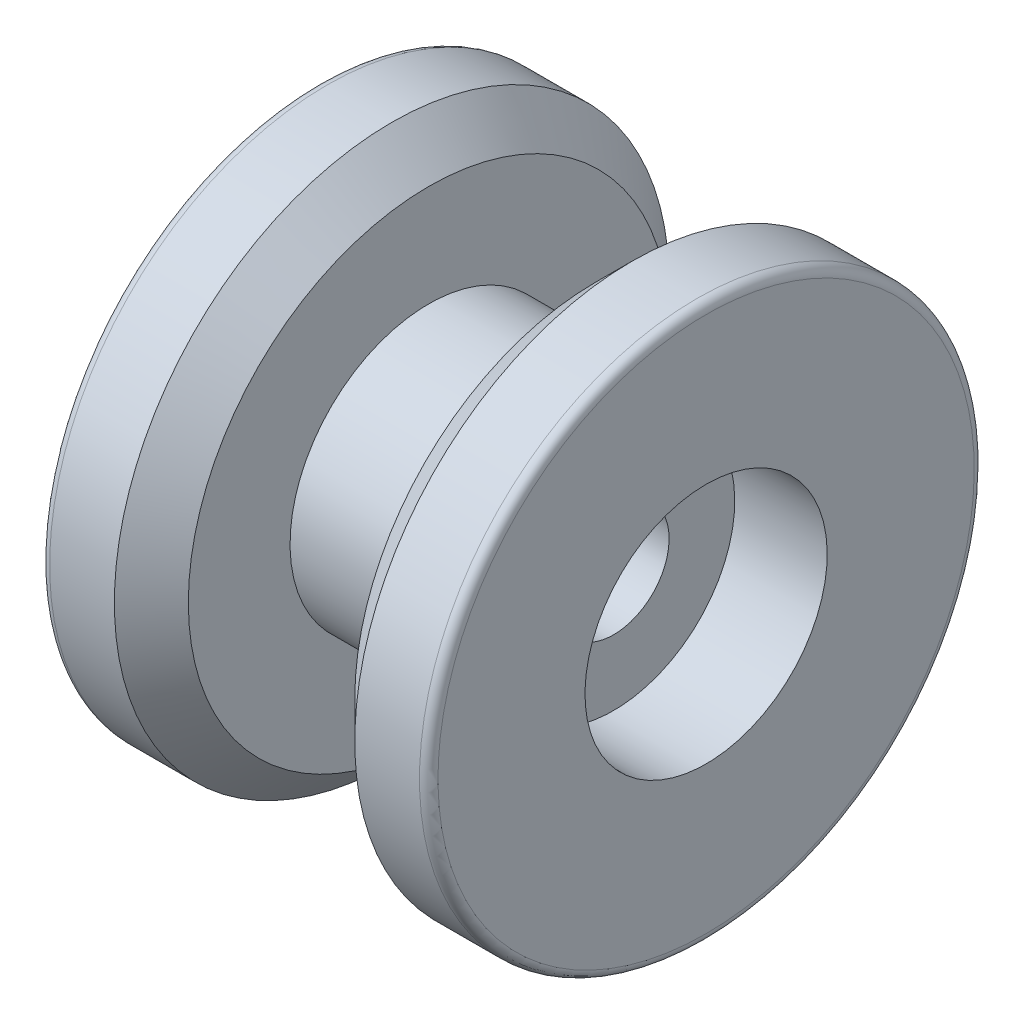
ISO-10303-21;
HEADER;
FILE_DESCRIPTION(('STEP AP214'),'2;1');
FILE_NAME('part.step','',(''),(''),'','','');
FILE_SCHEMA(('AUTOMOTIVE_DESIGN { 1 0 10303 214 1 1 1 1 }'));
ENDSEC;
DATA;
#1=APPLICATION_CONTEXT('core data for automotive mechanical design processes');
#2=APPLICATION_PROTOCOL_DEFINITION('international standard','automotive_design',2000,#1);
#3=PRODUCT_CONTEXT('',#1,'mechanical');
#4=PRODUCT('Part','Part','',(#3));
#5=PRODUCT_RELATED_PRODUCT_CATEGORY('part','',(#4));
#6=PRODUCT_DEFINITION_FORMATION('','',#4);
#7=PRODUCT_DEFINITION_CONTEXT('part definition',#1,'design');
#8=PRODUCT_DEFINITION('design','',#6,#7);
#9=PRODUCT_DEFINITION_SHAPE('','',#8);
#10=(LENGTH_UNIT() NAMED_UNIT(*) SI_UNIT(.MILLI.,.METRE.));
#11=(NAMED_UNIT(*) PLANE_ANGLE_UNIT() SI_UNIT($,.RADIAN.));
#12=(NAMED_UNIT(*) SI_UNIT($,.STERADIAN.) SOLID_ANGLE_UNIT());
#13=UNCERTAINTY_MEASURE_WITH_UNIT(LENGTH_MEASURE(1.E-05),#10,'distance_accuracy_value','');
#14=(GEOMETRIC_REPRESENTATION_CONTEXT(3) GLOBAL_UNCERTAINTY_ASSIGNED_CONTEXT((#13)) GLOBAL_UNIT_ASSIGNED_CONTEXT((#10,
#11,#12)) REPRESENTATION_CONTEXT('',''));
#15=CARTESIAN_POINT('',(0.,0.,0.));
#16=DIRECTION('',(0.,0.,1.));
#17=DIRECTION('',(1.,0.,0.));
#18=AXIS2_PLACEMENT_3D('',#15,#16,#17);
#19=CARTESIAN_POINT('',(-21.,0.,0.));
#20=DIRECTION('',(1.,0.,0.));
#21=DIRECTION('',(0.,1.,0.));
#22=AXIS2_PLACEMENT_3D('',#19,#20,#21);
#23=CYLINDRICAL_SURFACE('',#22,6.);
#24=CARTESIAN_POINT('',(-21.,0.,0.));
#25=DIRECTION('',(1.,0.,0.));
#26=DIRECTION('',(0.,1.,0.));
#27=AXIS2_PLACEMENT_3D('',#24,#25,#26);
#28=CIRCLE('',#27,6.);
#29=CARTESIAN_POINT('',(-21.,6.,0.));
#30=VERTEX_POINT('',#29);
#31=EDGE_CURVE('E89',#30,#30,#28,.T.);
#32=ORIENTED_EDGE('',*,*,#31,.F.);
#33=EDGE_LOOP('',(#32));
#34=FACE_BOUND('',#33,.T.);
#35=CARTESIAN_POINT('',(11.,0.,0.));
#36=DIRECTION('',(1.,0.,0.));
#37=DIRECTION('',(0.,1.,0.));
#38=AXIS2_PLACEMENT_3D('',#35,#36,#37);
#39=CIRCLE('',#38,6.);
#40=CARTESIAN_POINT('',(11.,6.,0.));
#41=VERTEX_POINT('',#40);
#42=EDGE_CURVE('E45',#41,#41,#39,.F.);
#43=ORIENTED_EDGE('',*,*,#42,.F.);
#44=EDGE_LOOP('',(#43));
#45=FACE_BOUND('',#44,.T.);
#46=ADVANCED_FACE('F41',(#34,#45),#23,.F.);
#47=CARTESIAN_POINT('',(-21.,30.,0.));
#48=DIRECTION('',(1.,0.,0.));
#49=DIRECTION('',(0.,1.,0.));
#50=AXIS2_PLACEMENT_3D('',#47,#48,#49);
#51=PLANE('',#50);
#52=CARTESIAN_POINT('',(-21.,0.,0.));
#53=DIRECTION('',(1.,0.,0.));
#54=DIRECTION('',(0.,1.,0.));
#55=AXIS2_PLACEMENT_3D('',#52,#53,#54);
#56=CIRCLE('',#55,29.);
#57=CARTESIAN_POINT('',(-21.,29.,0.));
#58=VERTEX_POINT('',#57);
#59=EDGE_CURVE('E50',#58,#58,#56,.F.);
#60=ORIENTED_EDGE('',*,*,#59,.T.);
#61=EDGE_LOOP('',(#60));
#62=FACE_BOUND('',#61,.T.);
#63=ORIENTED_EDGE('',*,*,#31,.T.);
#64=EDGE_LOOP('',(#63));
#65=FACE_BOUND('',#64,.T.);
#66=ADVANCED_FACE('F109',(#62,#65),#51,.F.);
#67=CARTESIAN_POINT('',(21.,0.,0.));
#68=DIRECTION('',(-1.,0.,0.));
#69=DIRECTION('',(0.,-1.,0.));
#70=AXIS2_PLACEMENT_3D('',#67,#68,#69);
#71=PLANE('',#70);
#72=CARTESIAN_POINT('',(21.,0.,0.));
#73=DIRECTION('',(1.,0.,0.));
#74=DIRECTION('',(0.,1.,0.));
#75=AXIS2_PLACEMENT_3D('',#72,#73,#74);
#76=CIRCLE('',#75,13.1);
#77=CARTESIAN_POINT('',(21.,13.1,0.));
#78=VERTEX_POINT('',#77);
#79=EDGE_CURVE('E93',#78,#78,#76,.T.);
#80=ORIENTED_EDGE('',*,*,#79,.F.);
#81=EDGE_LOOP('',(#80));
#82=FACE_BOUND('',#81,.T.);
#83=CARTESIAN_POINT('',(21.,0.,0.));
#84=DIRECTION('',(-1.,0.,0.));
#85=DIRECTION('',(0.,-1.,0.));
#86=AXIS2_PLACEMENT_3D('',#83,#84,#85);
#87=CIRCLE('',#86,29.);
#88=CARTESIAN_POINT('',(21.,-29.,0.));
#89=VERTEX_POINT('',#88);
#90=EDGE_CURVE('E55',#89,#89,#87,.F.);
#91=ORIENTED_EDGE('',*,*,#90,.T.);
#92=EDGE_LOOP('',(#91));
#93=FACE_BOUND('',#92,.T.);
#94=ADVANCED_FACE('F115',(#82,#93),#71,.F.);
#95=CARTESIAN_POINT('',(-21.,0.,0.));
#96=DIRECTION('',(-1.,0.,0.));
#97=DIRECTION('',(0.,-1.,0.));
#98=AXIS2_PLACEMENT_3D('',#95,#96,#97);
#99=CYLINDRICAL_SURFACE('',#98,30.);
#100=CARTESIAN_POINT('',(20.,0.,0.));
#101=DIRECTION('',(-1.,0.,0.));
#102=DIRECTION('',(0.,-1.,0.));
#103=AXIS2_PLACEMENT_3D('',#100,#101,#102);
#104=CIRCLE('',#103,30.);
#105=CARTESIAN_POINT('',(20.,-30.,0.));
#106=VERTEX_POINT('',#105);
#107=EDGE_CURVE('E61',#106,#106,#104,.T.);
#108=ORIENTED_EDGE('',*,*,#107,.T.);
#109=EDGE_LOOP('',(#108));
#110=FACE_BOUND('',#109,.T.);
#111=CARTESIAN_POINT('',(13.,0.,0.));
#112=DIRECTION('',(1.,0.,0.));
#113=DIRECTION('',(0.,1.,0.));
#114=AXIS2_PLACEMENT_3D('',#111,#112,#113);
#115=CIRCLE('',#114,30.);
#116=CARTESIAN_POINT('',(13.,30.,0.));
#117=VERTEX_POINT('',#116);
#118=EDGE_CURVE('E73',#117,#117,#115,.T.);
#119=ORIENTED_EDGE('',*,*,#118,.T.);
#120=EDGE_LOOP('',(#119));
#121=FACE_BOUND('',#120,.T.);
#122=ADVANCED_FACE('F138',(#110,#121),#99,.T.);
#123=CARTESIAN_POINT('',(9.,30.,0.));
#124=DIRECTION('',(1.,0.,0.));
#125=DIRECTION('',(0.,1.,0.));
#126=AXIS2_PLACEMENT_3D('',#123,#124,#125);
#127=PLANE('',#126);
#128=CARTESIAN_POINT('',(9.,0.,0.));
#129=DIRECTION('',(1.,0.,0.));
#130=DIRECTION('',(0.,1.,0.));
#131=AXIS2_PLACEMENT_3D('',#128,#129,#130);
#132=CIRCLE('',#131,26.);
#133=CARTESIAN_POINT('',(9.,26.,0.));
#134=VERTEX_POINT('',#133);
#135=EDGE_CURVE('E77',#134,#134,#132,.F.);
#136=ORIENTED_EDGE('',*,*,#135,.T.);
#137=EDGE_LOOP('',(#136));
#138=FACE_BOUND('',#137,.T.);
#139=CARTESIAN_POINT('',(9.,0.,0.));
#140=DIRECTION('',(-1.,0.,0.));
#141=DIRECTION('',(0.,-1.,0.));
#142=AXIS2_PLACEMENT_3D('',#139,#140,#141);
#143=CIRCLE('',#142,15.);
#144=CARTESIAN_POINT('',(9.00000000000001,-15.,0.));
#145=VERTEX_POINT('',#144);
#146=EDGE_CURVE('E81',#145,#145,#143,.T.);
#147=ORIENTED_EDGE('',*,*,#146,.F.);
#148=EDGE_LOOP('',(#147));
#149=FACE_BOUND('',#148,.T.);
#150=ADVANCED_FACE('F134',(#138,#149),#127,.F.);
#151=CARTESIAN_POINT('',(-21.,0.,0.));
#152=DIRECTION('',(-1.,0.,0.));
#153=DIRECTION('',(0.,-1.,0.));
#154=AXIS2_PLACEMENT_3D('',#151,#152,#153);
#155=CYLINDRICAL_SURFACE('',#154,15.);
#156=CARTESIAN_POINT('',(-9.,0.,0.));
#157=DIRECTION('',(-1.,0.,0.));
#158=DIRECTION('',(0.,-1.,0.));
#159=AXIS2_PLACEMENT_3D('',#156,#157,#158);
#160=CIRCLE('',#159,15.);
#161=CARTESIAN_POINT('',(-8.99999999999999,-15.,0.));
#162=VERTEX_POINT('',#161);
#163=EDGE_CURVE('E85',#162,#162,#160,.T.);
#164=ORIENTED_EDGE('',*,*,#163,.F.);
#165=EDGE_LOOP('',(#164));
#166=FACE_BOUND('',#165,.T.);
#167=ORIENTED_EDGE('',*,*,#146,.T.);
#168=EDGE_LOOP('',(#167));
#169=FACE_BOUND('',#168,.T.);
#170=ADVANCED_FACE('F130',(#166,#169),#155,.T.);
#171=CARTESIAN_POINT('',(-9.,15.,0.));
#172=DIRECTION('',(-1.,0.,0.));
#173=DIRECTION('',(0.,-1.,0.));
#174=AXIS2_PLACEMENT_3D('',#171,#172,#173);
#175=PLANE('',#174);
#176=CARTESIAN_POINT('',(-8.99999999999999,0.,0.));
#177=DIRECTION('',(-1.,0.,0.));
#178=DIRECTION('',(0.,-1.,0.));
#179=AXIS2_PLACEMENT_3D('',#176,#177,#178);
#180=CIRCLE('',#179,25.9999999999999);
#181=CARTESIAN_POINT('',(-8.99999999999999,-25.9999999999999,0.));
#182=VERTEX_POINT('',#181);
#183=EDGE_CURVE('E65',#182,#182,#180,.F.);
#184=ORIENTED_EDGE('',*,*,#183,.T.);
#185=EDGE_LOOP('',(#184));
#186=FACE_BOUND('',#185,.T.);
#187=ORIENTED_EDGE('',*,*,#163,.T.);
#188=EDGE_LOOP('',(#187));
#189=FACE_BOUND('',#188,.T.);
#190=ADVANCED_FACE('F127',(#186,#189),#175,.F.);
#191=CARTESIAN_POINT('',(-21.,0.,0.));
#192=DIRECTION('',(-1.,0.,0.));
#193=DIRECTION('',(0.,-1.,0.));
#194=AXIS2_PLACEMENT_3D('',#191,#192,#193);
#195=CYLINDRICAL_SURFACE('',#194,30.);
#196=CARTESIAN_POINT('',(-20.,0.,0.));
#197=DIRECTION('',(1.,0.,0.));
#198=DIRECTION('',(0.,1.,0.));
#199=AXIS2_PLACEMENT_3D('',#196,#197,#198);
#200=CIRCLE('',#199,30.);
#201=CARTESIAN_POINT('',(-20.,30.,0.));
#202=VERTEX_POINT('',#201);
#203=EDGE_CURVE('E10',#202,#202,#200,.T.);
#204=ORIENTED_EDGE('',*,*,#203,.T.);
#205=EDGE_LOOP('',(#204));
#206=FACE_BOUND('',#205,.T.);
#207=CARTESIAN_POINT('',(-13.,0.,0.));
#208=DIRECTION('',(-1.,0.,0.));
#209=DIRECTION('',(0.,-1.,0.));
#210=AXIS2_PLACEMENT_3D('',#207,#208,#209);
#211=CIRCLE('',#210,30.);
#212=CARTESIAN_POINT('',(-13.,-30.,0.));
#213=VERTEX_POINT('',#212);
#214=EDGE_CURVE('E69',#213,#213,#211,.T.);
#215=ORIENTED_EDGE('',*,*,#214,.T.);
#216=EDGE_LOOP('',(#215));
#217=FACE_BOUND('',#216,.T.);
#218=ADVANCED_FACE('F123',(#206,#217),#195,.T.);
#219=CARTESIAN_POINT('',(9.00000000000001,0.,0.));
#220=DIRECTION('',(1.,0.,0.));
#221=DIRECTION('',(0.,1.,0.));
#222=AXIS2_PLACEMENT_3D('',#219,#220,#221);
#223=CONICAL_SURFACE('',#222,26.,0.785398163397447);
#224=ORIENTED_EDGE('',*,*,#118,.F.);
#225=EDGE_LOOP('',(#224));
#226=FACE_BOUND('',#225,.T.);
#227=ORIENTED_EDGE('',*,*,#135,.F.);
#228=EDGE_LOOP('',(#227));
#229=FACE_BOUND('',#228,.T.);
#230=ADVANCED_FACE('F126',(#226,#229),#223,.T.);
#231=CARTESIAN_POINT('',(-13.,0.,0.));
#232=DIRECTION('',(-1.,0.,0.));
#233=DIRECTION('',(0.,-1.,0.));
#234=AXIS2_PLACEMENT_3D('',#231,#232,#233);
#235=CONICAL_SURFACE('',#234,30.,0.785398163397451);
#236=ORIENTED_EDGE('',*,*,#183,.F.);
#237=EDGE_LOOP('',(#236));
#238=FACE_BOUND('',#237,.T.);
#239=ORIENTED_EDGE('',*,*,#214,.F.);
#240=EDGE_LOOP('',(#239));
#241=FACE_BOUND('',#240,.T.);
#242=ADVANCED_FACE('F152',(#238,#241),#235,.T.);
#243=CARTESIAN_POINT('',(20.,0.,0.));
#244=DIRECTION('',(-1.,0.,0.));
#245=DIRECTION('',(0.,-1.,0.));
#246=AXIS2_PLACEMENT_3D('',#243,#244,#245);
#247=TOROIDAL_SURFACE('',#246,29.,1.);
#248=ORIENTED_EDGE('',*,*,#90,.F.);
#249=EDGE_LOOP('',(#248));
#250=FACE_BOUND('',#249,.T.);
#251=ORIENTED_EDGE('',*,*,#107,.F.);
#252=EDGE_LOOP('',(#251));
#253=FACE_BOUND('',#252,.T.);
#254=ADVANCED_FACE('F157',(#250,#253),#247,.T.);
#255=CARTESIAN_POINT('',(-20.,0.,0.));
#256=DIRECTION('',(1.,0.,0.));
#257=DIRECTION('',(0.,1.,0.));
#258=AXIS2_PLACEMENT_3D('',#255,#256,#257);
#259=TOROIDAL_SURFACE('',#258,29.,1.);
#260=ORIENTED_EDGE('',*,*,#203,.F.);
#261=EDGE_LOOP('',(#260));
#262=FACE_BOUND('',#261,.T.);
#263=ORIENTED_EDGE('',*,*,#59,.F.);
#264=EDGE_LOOP('',(#263));
#265=FACE_BOUND('',#264,.T.);
#266=ADVANCED_FACE('F43',(#262,#265),#259,.T.);
#267=CARTESIAN_POINT('',(11.,0.,0.));
#268=DIRECTION('',(1.,0.,0.));
#269=DIRECTION('',(0.,1.,0.));
#270=AXIS2_PLACEMENT_3D('',#267,#268,#269);
#271=PLANE('',#270);
#272=CARTESIAN_POINT('',(11.,0.,0.));
#273=DIRECTION('',(1.,0.,0.));
#274=DIRECTION('',(0.,1.,0.));
#275=AXIS2_PLACEMENT_3D('',#272,#273,#274);
#276=CIRCLE('',#275,13.1);
#277=CARTESIAN_POINT('',(11.,13.1,0.));
#278=VERTEX_POINT('',#277);
#279=EDGE_CURVE('E97',#278,#278,#276,.T.);
#280=ORIENTED_EDGE('',*,*,#279,.T.);
#281=EDGE_LOOP('',(#280));
#282=FACE_BOUND('',#281,.T.);
#283=ORIENTED_EDGE('',*,*,#42,.T.);
#284=EDGE_LOOP('',(#283));
#285=FACE_BOUND('',#284,.T.);
#286=ADVANCED_FACE('F106',(#282,#285),#271,.T.);
#287=CARTESIAN_POINT('',(11.,0.,0.));
#288=DIRECTION('',(1.,0.,0.));
#289=DIRECTION('',(0.,1.,0.));
#290=AXIS2_PLACEMENT_3D('',#287,#288,#289);
#291=CYLINDRICAL_SURFACE('',#290,13.1);
#292=ORIENTED_EDGE('',*,*,#279,.F.);
#293=EDGE_LOOP('',(#292));
#294=FACE_BOUND('',#293,.T.);
#295=ORIENTED_EDGE('',*,*,#79,.T.);
#296=EDGE_LOOP('',(#295));
#297=FACE_BOUND('',#296,.T.);
#298=ADVANCED_FACE('F121',(#294,#297),#291,.F.);
#299=CLOSED_SHELL('',(#46,#66,#94,#122,#150,#170,#190,#218,#230,#242,#254,#266,#286,#298));
#300=MANIFOLD_SOLID_BREP('B2',#299);
#301=ADVANCED_BREP_SHAPE_REPRESENTATION('',(#18,#300),#14);
#302=SHAPE_DEFINITION_REPRESENTATION(#9,#301);
ENDSEC;
END-ISO-10303-21;
